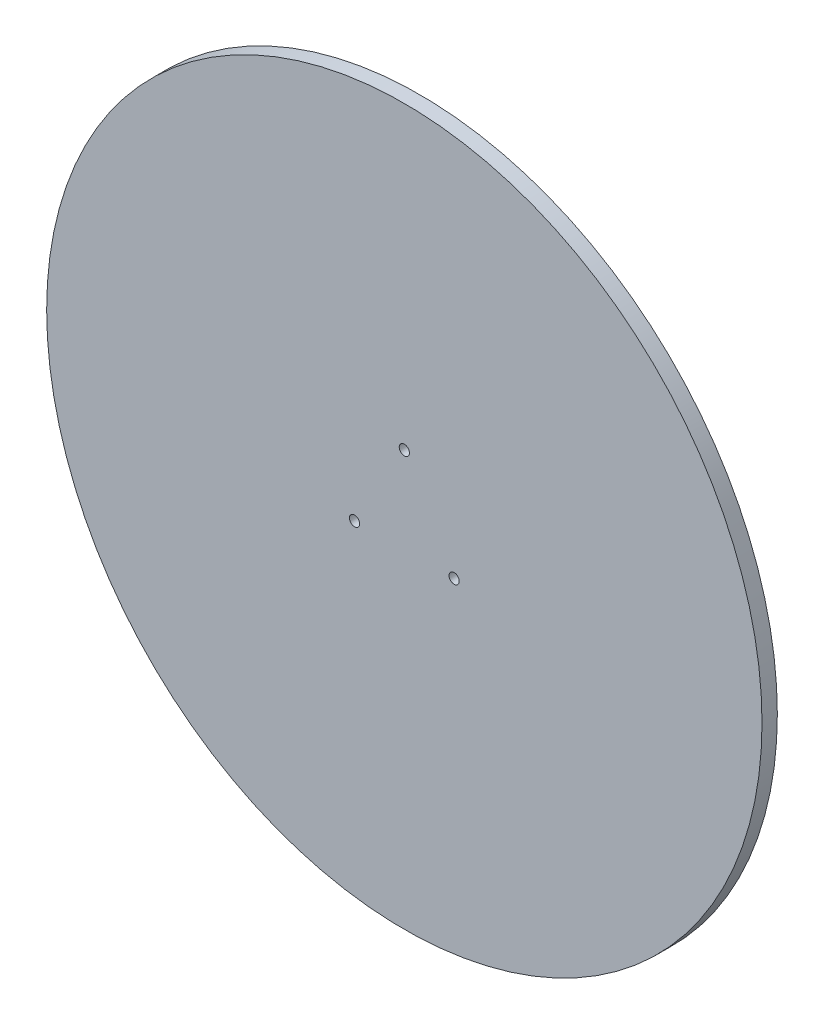
ISO-10303-21;
HEADER;
FILE_DESCRIPTION(('STEP AP214'),'2;1');
FILE_NAME('part.step','',(''),(''),'','','');
FILE_SCHEMA(('AUTOMOTIVE_DESIGN { 1 0 10303 214 1 1 1 1 }'));
ENDSEC;
DATA;
#1=APPLICATION_CONTEXT('core data for automotive mechanical design processes');
#2=APPLICATION_PROTOCOL_DEFINITION('international standard','automotive_design',2000,#1);
#3=PRODUCT_CONTEXT('',#1,'mechanical');
#4=PRODUCT('Part','Part','',(#3));
#5=PRODUCT_RELATED_PRODUCT_CATEGORY('part','',(#4));
#6=PRODUCT_DEFINITION_FORMATION('','',#4);
#7=PRODUCT_DEFINITION_CONTEXT('part definition',#1,'design');
#8=PRODUCT_DEFINITION('design','',#6,#7);
#9=PRODUCT_DEFINITION_SHAPE('','',#8);
#10=(LENGTH_UNIT() NAMED_UNIT(*) SI_UNIT(.MILLI.,.METRE.));
#11=(NAMED_UNIT(*) PLANE_ANGLE_UNIT() SI_UNIT($,.RADIAN.));
#12=(NAMED_UNIT(*) SI_UNIT($,.STERADIAN.) SOLID_ANGLE_UNIT());
#13=UNCERTAINTY_MEASURE_WITH_UNIT(LENGTH_MEASURE(1.E-05),#10,'distance_accuracy_value','');
#14=(GEOMETRIC_REPRESENTATION_CONTEXT(3) GLOBAL_UNCERTAINTY_ASSIGNED_CONTEXT((#13)) GLOBAL_UNIT_ASSIGNED_CONTEXT((#10,
#11,#12)) REPRESENTATION_CONTEXT('',''));
#15=CARTESIAN_POINT('',(0.,0.,0.));
#16=DIRECTION('',(0.,0.,1.));
#17=DIRECTION('',(1.,0.,0.));
#18=AXIS2_PLACEMENT_3D('',#15,#16,#17);
#19=CARTESIAN_POINT('',(0.,0.,6.));
#20=DIRECTION('',(0.,0.,1.));
#21=DIRECTION('',(1.,0.,0.));
#22=AXIS2_PLACEMENT_3D('',#19,#20,#21);
#23=PLANE('',#22);
#24=CARTESIAN_POINT('',(19.4855715851499,-11.25,6.));
#25=DIRECTION('',(0.,0.,1.));
#26=DIRECTION('',(1.,0.,0.));
#27=AXIS2_PLACEMENT_3D('',#24,#25,#26);
#28=CIRCLE('',#27,2.);
#29=CARTESIAN_POINT('',(21.4855715851499,-11.25,6.));
#30=VERTEX_POINT('',#29);
#31=EDGE_CURVE('E45',#30,#30,#28,.T.);
#32=ORIENTED_EDGE('',*,*,#31,.F.);
#33=EDGE_LOOP('',(#32));
#34=FACE_BOUND('',#33,.T.);
#35=CARTESIAN_POINT('',(0.,0.,6.));
#36=DIRECTION('',(0.,0.,1.));
#37=DIRECTION('',(1.,0.,0.));
#38=AXIS2_PLACEMENT_3D('',#35,#36,#37);
#39=CIRCLE('',#38,140.);
#40=CARTESIAN_POINT('',(140.,0.,6.));
#41=VERTEX_POINT('',#40);
#42=EDGE_CURVE('E10',#41,#41,#39,.T.);
#43=ORIENTED_EDGE('',*,*,#42,.T.);
#44=EDGE_LOOP('',(#43));
#45=FACE_BOUND('',#44,.T.);
#46=CARTESIAN_POINT('',(0.,22.5,6.));
#47=DIRECTION('',(0.,0.,1.));
#48=DIRECTION('',(1.,0.,0.));
#49=AXIS2_PLACEMENT_3D('',#46,#47,#48);
#50=CIRCLE('',#49,2.);
#51=CARTESIAN_POINT('',(2.,22.5,6.));
#52=VERTEX_POINT('',#51);
#53=EDGE_CURVE('E40',#52,#52,#50,.T.);
#54=ORIENTED_EDGE('',*,*,#53,.F.);
#55=EDGE_LOOP('',(#54));
#56=FACE_BOUND('',#55,.T.);
#57=CARTESIAN_POINT('',(-19.4855715851499,-11.25,6.));
#58=DIRECTION('',(0.,0.,1.));
#59=DIRECTION('',(1.,0.,0.));
#60=AXIS2_PLACEMENT_3D('',#57,#58,#59);
#61=CIRCLE('',#60,2.);
#62=CARTESIAN_POINT('',(-17.4855715851499,-11.25,6.));
#63=VERTEX_POINT('',#62);
#64=EDGE_CURVE('E51',#63,#63,#61,.T.);
#65=ORIENTED_EDGE('',*,*,#64,.F.);
#66=EDGE_LOOP('',(#65));
#67=FACE_BOUND('',#66,.T.);
#68=ADVANCED_FACE('F29',(#34,#45,#56,#67),#23,.T.);
#69=CARTESIAN_POINT('',(0.,0.,0.));
#70=DIRECTION('',(0.,0.,1.));
#71=DIRECTION('',(1.,0.,0.));
#72=AXIS2_PLACEMENT_3D('',#69,#70,#71);
#73=PLANE('',#72);
#74=CARTESIAN_POINT('',(0.,0.,0.));
#75=DIRECTION('',(0.,0.,1.));
#76=DIRECTION('',(1.,0.,0.));
#77=AXIS2_PLACEMENT_3D('',#74,#75,#76);
#78=CIRCLE('',#77,140.);
#79=CARTESIAN_POINT('',(140.,0.,0.));
#80=VERTEX_POINT('',#79);
#81=EDGE_CURVE('E33',#80,#80,#78,.T.);
#82=ORIENTED_EDGE('',*,*,#81,.F.);
#83=EDGE_LOOP('',(#82));
#84=FACE_BOUND('',#83,.T.);
#85=CARTESIAN_POINT('',(0.,22.5,0.));
#86=DIRECTION('',(0.,0.,1.));
#87=DIRECTION('',(1.,0.,0.));
#88=AXIS2_PLACEMENT_3D('',#85,#86,#87);
#89=CIRCLE('',#88,2.);
#90=CARTESIAN_POINT('',(2.,22.5,0.));
#91=VERTEX_POINT('',#90);
#92=EDGE_CURVE('E42',#91,#91,#89,.T.);
#93=ORIENTED_EDGE('',*,*,#92,.T.);
#94=EDGE_LOOP('',(#93));
#95=FACE_BOUND('',#94,.T.);
#96=CARTESIAN_POINT('',(19.4855715851499,-11.25,0.));
#97=DIRECTION('',(0.,0.,1.));
#98=DIRECTION('',(1.,0.,0.));
#99=AXIS2_PLACEMENT_3D('',#96,#97,#98);
#100=CIRCLE('',#99,2.);
#101=CARTESIAN_POINT('',(21.4855715851499,-11.25,0.));
#102=VERTEX_POINT('',#101);
#103=EDGE_CURVE('E48',#102,#102,#100,.T.);
#104=ORIENTED_EDGE('',*,*,#103,.T.);
#105=EDGE_LOOP('',(#104));
#106=FACE_BOUND('',#105,.T.);
#107=CARTESIAN_POINT('',(-19.4855715851499,-11.25,0.));
#108=DIRECTION('',(0.,0.,1.));
#109=DIRECTION('',(1.,0.,0.));
#110=AXIS2_PLACEMENT_3D('',#107,#108,#109);
#111=CIRCLE('',#110,2.);
#112=CARTESIAN_POINT('',(-17.4855715851499,-11.25,0.));
#113=VERTEX_POINT('',#112);
#114=EDGE_CURVE('E54',#113,#113,#111,.T.);
#115=ORIENTED_EDGE('',*,*,#114,.T.);
#116=EDGE_LOOP('',(#115));
#117=FACE_BOUND('',#116,.T.);
#118=ADVANCED_FACE('F64',(#84,#95,#106,#117),#73,.F.);
#119=CARTESIAN_POINT('',(0.,0.,6.));
#120=DIRECTION('',(0.,0.,-1.));
#121=DIRECTION('',(-1.,0.,0.));
#122=AXIS2_PLACEMENT_3D('',#119,#120,#121);
#123=CYLINDRICAL_SURFACE('',#122,140.);
#124=ORIENTED_EDGE('',*,*,#42,.F.);
#125=EDGE_LOOP('',(#124));
#126=FACE_BOUND('',#125,.T.);
#127=ORIENTED_EDGE('',*,*,#81,.T.);
#128=EDGE_LOOP('',(#127));
#129=FACE_BOUND('',#128,.T.);
#130=ADVANCED_FACE('F31',(#126,#129),#123,.T.);
#131=CARTESIAN_POINT('',(0.,22.5,6.));
#132=DIRECTION('',(0.,0.,-1.));
#133=DIRECTION('',(-1.,0.,0.));
#134=AXIS2_PLACEMENT_3D('',#131,#132,#133);
#135=CYLINDRICAL_SURFACE('',#134,2.);
#136=ORIENTED_EDGE('',*,*,#53,.T.);
#137=EDGE_LOOP('',(#136));
#138=FACE_BOUND('',#137,.T.);
#139=ORIENTED_EDGE('',*,*,#92,.F.);
#140=EDGE_LOOP('',(#139));
#141=FACE_BOUND('',#140,.T.);
#142=ADVANCED_FACE('F73',(#138,#141),#135,.F.);
#143=CARTESIAN_POINT('',(19.4855715851499,-11.25,6.));
#144=DIRECTION('',(0.,0.,-1.));
#145=DIRECTION('',(-1.,0.,0.));
#146=AXIS2_PLACEMENT_3D('',#143,#144,#145);
#147=CYLINDRICAL_SURFACE('',#146,2.);
#148=ORIENTED_EDGE('',*,*,#31,.T.);
#149=EDGE_LOOP('',(#148));
#150=FACE_BOUND('',#149,.T.);
#151=ORIENTED_EDGE('',*,*,#103,.F.);
#152=EDGE_LOOP('',(#151));
#153=FACE_BOUND('',#152,.T.);
#154=ADVANCED_FACE('F76',(#150,#153),#147,.F.);
#155=CARTESIAN_POINT('',(-19.4855715851499,-11.25,6.));
#156=DIRECTION('',(0.,0.,-1.));
#157=DIRECTION('',(-1.,0.,0.));
#158=AXIS2_PLACEMENT_3D('',#155,#156,#157);
#159=CYLINDRICAL_SURFACE('',#158,2.);
#160=ORIENTED_EDGE('',*,*,#64,.T.);
#161=EDGE_LOOP('',(#160));
#162=FACE_BOUND('',#161,.T.);
#163=ORIENTED_EDGE('',*,*,#114,.F.);
#164=EDGE_LOOP('',(#163));
#165=FACE_BOUND('',#164,.T.);
#166=ADVANCED_FACE('F60',(#162,#165),#159,.F.);
#167=CLOSED_SHELL('',(#68,#118,#130,#142,#154,#166));
#168=MANIFOLD_SOLID_BREP('B2',#167);
#169=ADVANCED_BREP_SHAPE_REPRESENTATION('',(#18,#168),#14);
#170=SHAPE_DEFINITION_REPRESENTATION(#9,#169);
ENDSEC;
END-ISO-10303-21;
